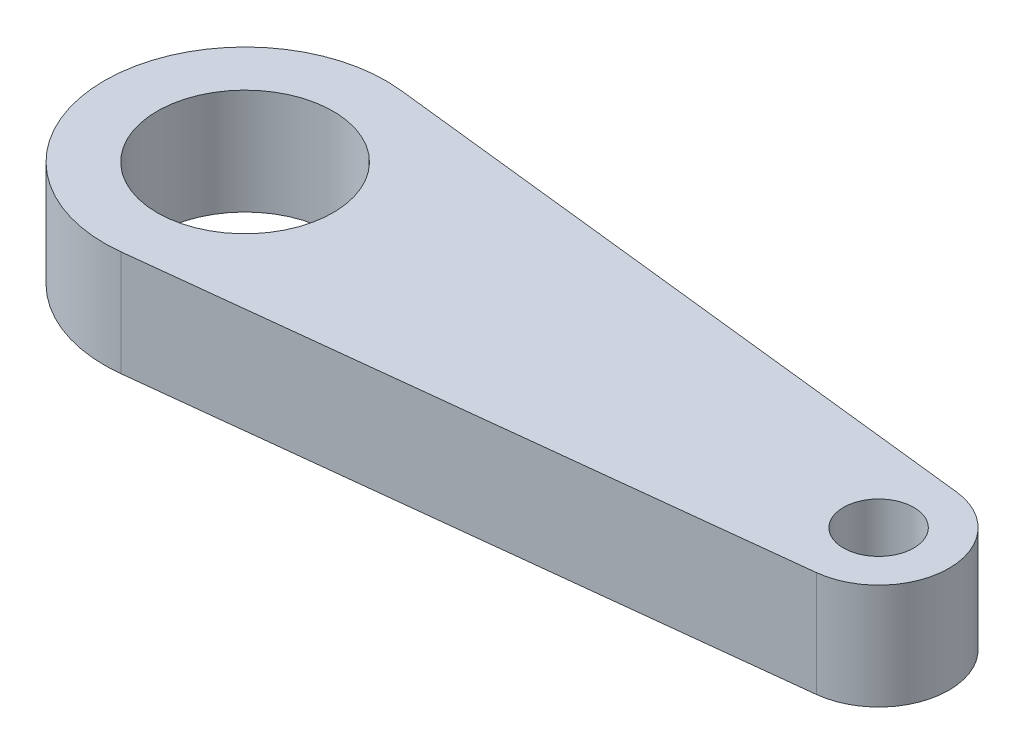
ISO-10303-21;
HEADER;
FILE_DESCRIPTION(('STEP AP214'),'2;1');
FILE_NAME('part.step','',(''),(''),'','','');
FILE_SCHEMA(('AUTOMOTIVE_DESIGN { 1 0 10303 214 1 1 1 1 }'));
ENDSEC;
DATA;
#1=APPLICATION_CONTEXT('core data for automotive mechanical design processes');
#2=APPLICATION_PROTOCOL_DEFINITION('international standard','automotive_design',2000,#1);
#3=PRODUCT_CONTEXT('',#1,'mechanical');
#4=PRODUCT('Part','Part','',(#3));
#5=PRODUCT_RELATED_PRODUCT_CATEGORY('part','',(#4));
#6=PRODUCT_DEFINITION_FORMATION('','',#4);
#7=PRODUCT_DEFINITION_CONTEXT('part definition',#1,'design');
#8=PRODUCT_DEFINITION('design','',#6,#7);
#9=PRODUCT_DEFINITION_SHAPE('','',#8);
#10=(LENGTH_UNIT() NAMED_UNIT(*) SI_UNIT(.MILLI.,.METRE.));
#11=(NAMED_UNIT(*) PLANE_ANGLE_UNIT() SI_UNIT($,.RADIAN.));
#12=(NAMED_UNIT(*) SI_UNIT($,.STERADIAN.) SOLID_ANGLE_UNIT());
#13=UNCERTAINTY_MEASURE_WITH_UNIT(LENGTH_MEASURE(1.E-05),#10,'distance_accuracy_value','');
#14=(GEOMETRIC_REPRESENTATION_CONTEXT(3) GLOBAL_UNCERTAINTY_ASSIGNED_CONTEXT((#13)) GLOBAL_UNIT_ASSIGNED_CONTEXT((#10,
#11,#12)) REPRESENTATION_CONTEXT('',''));
#15=CARTESIAN_POINT('',(0.,0.,0.));
#16=DIRECTION('',(0.,0.,1.));
#17=DIRECTION('',(1.,0.,0.));
#18=AXIS2_PLACEMENT_3D('',#15,#16,#17);
#19=CARTESIAN_POINT('',(18.,3.,0.));
#20=DIRECTION('',(0.,1.,0.));
#21=DIRECTION('',(0.,0.,1.));
#22=AXIS2_PLACEMENT_3D('',#19,#20,#21);
#23=PLANE('',#22);
#24=CARTESIAN_POINT('',(18.,3.,0.));
#25=DIRECTION('',(0.,1.,0.));
#26=DIRECTION('',(0.,0.,1.));
#27=AXIS2_PLACEMENT_3D('',#24,#25,#26);
#28=CIRCLE('',#27,1.);
#29=CARTESIAN_POINT('',(18.,3.,1.));
#30=VERTEX_POINT('',#29);
#31=EDGE_CURVE('E100',#30,#30,#28,.T.);
#32=ORIENTED_EDGE('',*,*,#31,.F.);
#33=EDGE_LOOP('',(#32));
#34=FACE_BOUND('',#33,.T.);
#35=CARTESIAN_POINT('',(18.,3.,0.));
#36=DIRECTION('',(0.,1.,0.));
#37=DIRECTION('',(0.,0.,1.));
#38=AXIS2_PLACEMENT_3D('',#35,#36,#37);
#39=CIRCLE('',#38,2.);
#40=CARTESIAN_POINT('',(18.2222222222222,3.,1.98761597999981));
#41=VERTEX_POINT('',#40);
#42=CARTESIAN_POINT('',(18.2222222222222,3.,-1.98761597999981));
#43=VERTEX_POINT('',#42);
#44=EDGE_CURVE('E85',#41,#43,#39,.T.);
#45=ORIENTED_EDGE('',*,*,#44,.T.);
#46=DIRECTION('',(-0.993807989999906,0.,-0.111111111111111));
#47=VECTOR('',#46,1.);
#48=CARTESIAN_POINT('',(18.2222222222222,3.,-1.98761597999981));
#49=LINE('',#48,#47);
#50=CARTESIAN_POINT('',(0.444444444444444,3.,-3.97523195999963));
#51=VERTEX_POINT('',#50);
#52=EDGE_CURVE('E80',#43,#51,#49,.T.);
#53=ORIENTED_EDGE('',*,*,#52,.T.);
#54=CARTESIAN_POINT('',(0.,3.,0.));
#55=DIRECTION('',(0.,1.,0.));
#56=DIRECTION('',(0.,0.,1.));
#57=AXIS2_PLACEMENT_3D('',#54,#55,#56);
#58=CIRCLE('',#57,4.);
#59=CARTESIAN_POINT('',(0.444444444444443,3.,3.97523195999963));
#60=VERTEX_POINT('',#59);
#61=EDGE_CURVE('E83',#51,#60,#58,.T.);
#62=ORIENTED_EDGE('',*,*,#61,.T.);
#63=DIRECTION('',(0.993807989999906,0.,-0.111111111111111));
#64=VECTOR('',#63,1.);
#65=CARTESIAN_POINT('',(18.2222222222222,3.,1.98761597999981));
#66=LINE('',#65,#64);
#67=EDGE_CURVE('E50',#60,#41,#66,.T.);
#68=ORIENTED_EDGE('',*,*,#67,.T.);
#69=EDGE_LOOP('',(#45,#53,#62,#68));
#70=FACE_BOUND('',#69,.T.);
#71=CARTESIAN_POINT('',(0.,3.,0.));
#72=DIRECTION('',(0.,1.,0.));
#73=DIRECTION('',(0.,0.,1.));
#74=AXIS2_PLACEMENT_3D('',#71,#72,#73);
#75=CIRCLE('',#74,2.5);
#76=CARTESIAN_POINT('',(0.,3.,2.5));
#77=VERTEX_POINT('',#76);
#78=EDGE_CURVE('E115',#77,#77,#75,.T.);
#79=ORIENTED_EDGE('',*,*,#78,.F.);
#80=EDGE_LOOP('',(#79));
#81=FACE_BOUND('',#80,.T.);
#82=ADVANCED_FACE('F33',(#34,#70,#81),#23,.T.);
#83=CARTESIAN_POINT('',(18.,0.,0.));
#84=DIRECTION('',(0.,1.,0.));
#85=DIRECTION('',(0.,0.,1.));
#86=AXIS2_PLACEMENT_3D('',#83,#84,#85);
#87=PLANE('',#86);
#88=CARTESIAN_POINT('',(18.,0.,0.));
#89=DIRECTION('',(0.,1.,0.));
#90=DIRECTION('',(0.,0.,1.));
#91=AXIS2_PLACEMENT_3D('',#88,#89,#90);
#92=CIRCLE('',#91,2.);
#93=CARTESIAN_POINT('',(18.2222222222222,0.,1.98761597999981));
#94=VERTEX_POINT('',#93);
#95=CARTESIAN_POINT('',(18.2222222222222,0.,-1.98761597999981));
#96=VERTEX_POINT('',#95);
#97=EDGE_CURVE('E97',#94,#96,#92,.T.);
#98=ORIENTED_EDGE('',*,*,#97,.F.);
#99=DIRECTION('',(0.993807989999906,0.,-0.111111111111111));
#100=VECTOR('',#99,1.);
#101=CARTESIAN_POINT('',(18.2222222222222,0.,1.98761597999981));
#102=LINE('',#101,#100);
#103=CARTESIAN_POINT('',(0.444444444444443,0.,3.97523195999963));
#104=VERTEX_POINT('',#103);
#105=EDGE_CURVE('E73',#104,#94,#102,.T.);
#106=ORIENTED_EDGE('',*,*,#105,.F.);
#107=CARTESIAN_POINT('',(0.,0.,0.));
#108=DIRECTION('',(0.,1.,0.));
#109=DIRECTION('',(0.,0.,1.));
#110=AXIS2_PLACEMENT_3D('',#107,#108,#109);
#111=CIRCLE('',#110,4.);
#112=CARTESIAN_POINT('',(0.444444444444444,0.,-3.97523195999963));
#113=VERTEX_POINT('',#112);
#114=EDGE_CURVE('E67',#113,#104,#111,.T.);
#115=ORIENTED_EDGE('',*,*,#114,.F.);
#116=DIRECTION('',(-0.993807989999906,0.,-0.111111111111111));
#117=VECTOR('',#116,1.);
#118=CARTESIAN_POINT('',(18.2222222222222,0.,-1.98761597999981));
#119=LINE('',#118,#117);
#120=EDGE_CURVE('E89',#96,#113,#119,.T.);
#121=ORIENTED_EDGE('',*,*,#120,.F.);
#122=EDGE_LOOP('',(#98,#106,#115,#121));
#123=FACE_BOUND('',#122,.T.);
#124=CARTESIAN_POINT('',(18.,0.,0.));
#125=DIRECTION('',(0.,1.,0.));
#126=DIRECTION('',(0.,0.,1.));
#127=AXIS2_PLACEMENT_3D('',#124,#125,#126);
#128=CIRCLE('',#127,1.);
#129=CARTESIAN_POINT('',(18.,0.,1.));
#130=VERTEX_POINT('',#129);
#131=EDGE_CURVE('E112',#130,#130,#128,.T.);
#132=ORIENTED_EDGE('',*,*,#131,.T.);
#133=EDGE_LOOP('',(#132));
#134=FACE_BOUND('',#133,.T.);
#135=CARTESIAN_POINT('',(0.,0.,0.));
#136=DIRECTION('',(0.,1.,0.));
#137=DIRECTION('',(0.,0.,1.));
#138=AXIS2_PLACEMENT_3D('',#135,#136,#137);
#139=CIRCLE('',#138,2.5);
#140=CARTESIAN_POINT('',(0.,0.,2.5));
#141=VERTEX_POINT('',#140);
#142=EDGE_CURVE('E118',#141,#141,#139,.T.);
#143=ORIENTED_EDGE('',*,*,#142,.T.);
#144=EDGE_LOOP('',(#143));
#145=FACE_BOUND('',#144,.T.);
#146=ADVANCED_FACE('F108',(#123,#134,#145),#87,.F.);
#147=CARTESIAN_POINT('',(18.,3.,0.));
#148=DIRECTION('',(0.,-1.,0.));
#149=DIRECTION('',(0.,0.,-1.));
#150=AXIS2_PLACEMENT_3D('',#147,#148,#149);
#151=CYLINDRICAL_SURFACE('',#150,2.);
#152=ORIENTED_EDGE('',*,*,#97,.T.);
#153=DIRECTION('',(0.,-1.,0.));
#154=VECTOR('',#153,1.);
#155=CARTESIAN_POINT('',(18.2222222222222,3.,-1.98761597999981));
#156=LINE('',#155,#154);
#157=EDGE_CURVE('E11',#43,#96,#156,.T.);
#158=ORIENTED_EDGE('',*,*,#157,.F.);
#159=ORIENTED_EDGE('',*,*,#44,.F.);
#160=DIRECTION('',(0.,-1.,0.));
#161=VECTOR('',#160,1.);
#162=CARTESIAN_POINT('',(18.2222222222222,3.,1.98761597999981));
#163=LINE('',#162,#161);
#164=EDGE_CURVE('E93',#41,#94,#163,.T.);
#165=ORIENTED_EDGE('',*,*,#164,.T.);
#166=EDGE_LOOP('',(#152,#158,#159,#165));
#167=FACE_BOUND('',#166,.T.);
#168=ADVANCED_FACE('F35',(#167),#151,.T.);
#169=CARTESIAN_POINT('',(18.2222222222222,3.,-1.98761597999981));
#170=DIRECTION('',(-0.111111111111111,0.,0.993807989999906));
#171=DIRECTION('',(0.993807989999907,0.,0.111111111111111));
#172=AXIS2_PLACEMENT_3D('',#169,#170,#171);
#173=PLANE('',#172);
#174=ORIENTED_EDGE('',*,*,#120,.T.);
#175=DIRECTION('',(0.,-1.,0.));
#176=VECTOR('',#175,1.);
#177=CARTESIAN_POINT('',(0.444444444444444,3.,-3.97523195999963));
#178=LINE('',#177,#176);
#179=EDGE_CURVE('E42',#51,#113,#178,.T.);
#180=ORIENTED_EDGE('',*,*,#179,.F.);
#181=ORIENTED_EDGE('',*,*,#52,.F.);
#182=ORIENTED_EDGE('',*,*,#157,.T.);
#183=EDGE_LOOP('',(#174,#180,#181,#182));
#184=FACE_BOUND('',#183,.T.);
#185=ADVANCED_FACE('F88',(#184),#173,.F.);
#186=CARTESIAN_POINT('',(0.,3.,0.));
#187=DIRECTION('',(0.,-1.,0.));
#188=DIRECTION('',(0.,0.,-1.));
#189=AXIS2_PLACEMENT_3D('',#186,#187,#188);
#190=CYLINDRICAL_SURFACE('',#189,4.);
#191=ORIENTED_EDGE('',*,*,#114,.T.);
#192=DIRECTION('',(0.,-1.,0.));
#193=VECTOR('',#192,1.);
#194=CARTESIAN_POINT('',(0.444444444444443,3.,3.97523195999963));
#195=LINE('',#194,#193);
#196=EDGE_CURVE('E90',#60,#104,#195,.T.);
#197=ORIENTED_EDGE('',*,*,#196,.F.);
#198=ORIENTED_EDGE('',*,*,#61,.F.);
#199=ORIENTED_EDGE('',*,*,#179,.T.);
#200=EDGE_LOOP('',(#191,#197,#198,#199));
#201=FACE_BOUND('',#200,.T.);
#202=ADVANCED_FACE('F91',(#201),#190,.T.);
#203=CARTESIAN_POINT('',(18.2222222222222,3.,1.98761597999981));
#204=DIRECTION('',(-0.111111111111111,0.,-0.993807989999906));
#205=DIRECTION('',(-0.993807989999907,0.,0.111111111111111));
#206=AXIS2_PLACEMENT_3D('',#203,#204,#205);
#207=PLANE('',#206);
#208=ORIENTED_EDGE('',*,*,#105,.T.);
#209=ORIENTED_EDGE('',*,*,#164,.F.);
#210=ORIENTED_EDGE('',*,*,#67,.F.);
#211=ORIENTED_EDGE('',*,*,#196,.T.);
#212=EDGE_LOOP('',(#208,#209,#210,#211));
#213=FACE_BOUND('',#212,.T.);
#214=ADVANCED_FACE('F105',(#213),#207,.F.);
#215=CARTESIAN_POINT('',(18.,3.,0.));
#216=DIRECTION('',(0.,-1.,0.));
#217=DIRECTION('',(0.,0.,-1.));
#218=AXIS2_PLACEMENT_3D('',#215,#216,#217);
#219=CYLINDRICAL_SURFACE('',#218,1.);
#220=ORIENTED_EDGE('',*,*,#31,.T.);
#221=EDGE_LOOP('',(#220));
#222=FACE_BOUND('',#221,.T.);
#223=ORIENTED_EDGE('',*,*,#131,.F.);
#224=EDGE_LOOP('',(#223));
#225=FACE_BOUND('',#224,.T.);
#226=ADVANCED_FACE('F135',(#222,#225),#219,.F.);
#227=CARTESIAN_POINT('',(0.,3.,0.));
#228=DIRECTION('',(0.,-1.,0.));
#229=DIRECTION('',(0.,0.,-1.));
#230=AXIS2_PLACEMENT_3D('',#227,#228,#229);
#231=CYLINDRICAL_SURFACE('',#230,2.5);
#232=ORIENTED_EDGE('',*,*,#78,.T.);
#233=EDGE_LOOP('',(#232));
#234=FACE_BOUND('',#233,.T.);
#235=ORIENTED_EDGE('',*,*,#142,.F.);
#236=EDGE_LOOP('',(#235));
#237=FACE_BOUND('',#236,.T.);
#238=ADVANCED_FACE('F124',(#234,#237),#231,.F.);
#239=CLOSED_SHELL('',(#82,#146,#168,#185,#202,#214,#226,#238));
#240=MANIFOLD_SOLID_BREP('B2',#239);
#241=ADVANCED_BREP_SHAPE_REPRESENTATION('',(#18,#240),#14);
#242=SHAPE_DEFINITION_REPRESENTATION(#9,#241);
ENDSEC;
END-ISO-10303-21;
